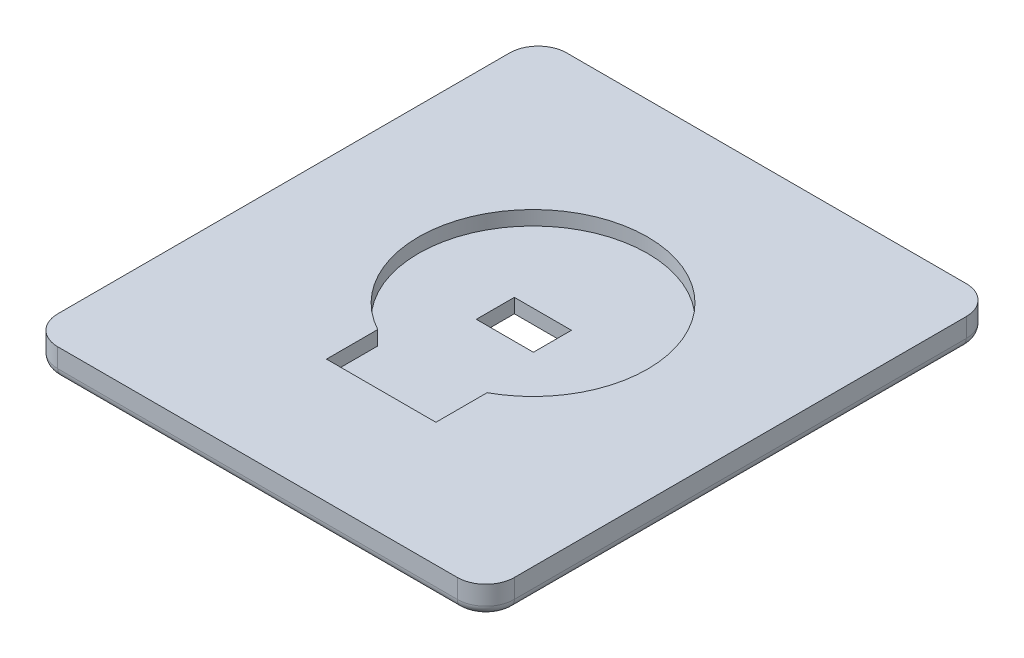
ISO-10303-21;
HEADER;
FILE_DESCRIPTION(('STEP AP214'),'2;1');
FILE_NAME('part.step','',(''),(''),'','','');
FILE_SCHEMA(('AUTOMOTIVE_DESIGN { 1 0 10303 214 1 1 1 1 }'));
ENDSEC;
DATA;
#1=APPLICATION_CONTEXT('core data for automotive mechanical design processes');
#2=APPLICATION_PROTOCOL_DEFINITION('international standard','automotive_design',2000,#1);
#3=PRODUCT_CONTEXT('',#1,'mechanical');
#4=PRODUCT('Part','Part','',(#3));
#5=PRODUCT_RELATED_PRODUCT_CATEGORY('part','',(#4));
#6=PRODUCT_DEFINITION_FORMATION('','',#4);
#7=PRODUCT_DEFINITION_CONTEXT('part definition',#1,'design');
#8=PRODUCT_DEFINITION('design','',#6,#7);
#9=PRODUCT_DEFINITION_SHAPE('','',#8);
#10=(LENGTH_UNIT() NAMED_UNIT(*) SI_UNIT(.MILLI.,.METRE.));
#11=(NAMED_UNIT(*) PLANE_ANGLE_UNIT() SI_UNIT($,.RADIAN.));
#12=(NAMED_UNIT(*) SI_UNIT($,.STERADIAN.) SOLID_ANGLE_UNIT());
#13=UNCERTAINTY_MEASURE_WITH_UNIT(LENGTH_MEASURE(1.E-05),#10,'distance_accuracy_value','');
#14=(GEOMETRIC_REPRESENTATION_CONTEXT(3) GLOBAL_UNCERTAINTY_ASSIGNED_CONTEXT((#13)) GLOBAL_UNIT_ASSIGNED_CONTEXT((#10,
#11,#12)) REPRESENTATION_CONTEXT('',''));
#15=CARTESIAN_POINT('',(0.,0.,0.));
#16=DIRECTION('',(0.,0.,1.));
#17=DIRECTION('',(1.,0.,0.));
#18=AXIS2_PLACEMENT_3D('',#15,#16,#17);
#19=CARTESIAN_POINT('',(0.,3.,0.));
#20=DIRECTION('',(0.,-1.,0.));
#21=DIRECTION('',(0.,0.,-1.));
#22=AXIS2_PLACEMENT_3D('',#19,#20,#21);
#23=PLANE('',#22);
#24=DIRECTION('',(0.,0.,-1.));
#25=VECTOR('',#24,1.);
#26=CARTESIAN_POINT('',(-5.75,3.,0.));
#27=LINE('',#26,#25);
#28=CARTESIAN_POINT('',(-5.75,3.,13.75));
#29=VERTEX_POINT('',#28);
#30=CARTESIAN_POINT('',(-5.75,3.,8.36494754341749));
#31=VERTEX_POINT('',#30);
#32=EDGE_CURVE('E213',#29,#31,#27,.T.);
#33=ORIENTED_EDGE('',*,*,#32,.T.);
#34=CARTESIAN_POINT('',(0.,3.,-2.21153846153821));
#35=DIRECTION('',(0.,1.,0.));
#36=DIRECTION('',(0.,0.,1.));
#37=AXIS2_PLACEMENT_3D('',#34,#35,#36);
#38=CIRCLE('',#37,12.0384615384618);
#39=CARTESIAN_POINT('',(5.75000000000001,3.,8.36494754341749));
#40=VERTEX_POINT('',#39);
#41=EDGE_CURVE('E209',#40,#31,#38,.T.);
#42=ORIENTED_EDGE('',*,*,#41,.F.);
#43=DIRECTION('',(0.,0.,-1.));
#44=VECTOR('',#43,1.);
#45=CARTESIAN_POINT('',(5.75000000000001,3.,0.));
#46=LINE('',#45,#44);
#47=CARTESIAN_POINT('',(5.75000000000001,3.,13.75));
#48=VERTEX_POINT('',#47);
#49=EDGE_CURVE('E223',#48,#40,#46,.T.);
#50=ORIENTED_EDGE('',*,*,#49,.F.);
#51=DIRECTION('',(1.,0.,0.));
#52=VECTOR('',#51,1.);
#53=CARTESIAN_POINT('',(0.,3.,13.75));
#54=LINE('',#53,#52);
#55=EDGE_CURVE('E238',#29,#48,#54,.T.);
#56=ORIENTED_EDGE('',*,*,#55,.F.);
#57=EDGE_LOOP('',(#33,#42,#50,#56));
#58=FACE_BOUND('',#57,.T.);
#59=DIRECTION('',(-1.,0.,0.));
#60=VECTOR('',#59,1.);
#61=CARTESIAN_POINT('',(-24.,3.,-26.75));
#62=LINE('',#61,#60);
#63=CARTESIAN_POINT('',(21.,3.,-26.75));
#64=VERTEX_POINT('',#63);
#65=CARTESIAN_POINT('',(-21.,3.,-26.75));
#66=VERTEX_POINT('',#65);
#67=EDGE_CURVE('E203',#64,#66,#62,.T.);
#68=ORIENTED_EDGE('',*,*,#67,.T.);
#69=CARTESIAN_POINT('',(-21.,3.,-23.75));
#70=DIRECTION('',(0.,-1.,0.));
#71=DIRECTION('',(0.,0.,-1.));
#72=AXIS2_PLACEMENT_3D('',#69,#70,#71);
#73=CIRCLE('',#72,3.);
#74=CARTESIAN_POINT('',(-24.,3.,-23.75));
#75=VERTEX_POINT('',#74);
#76=EDGE_CURVE('E290',#66,#75,#73,.F.);
#77=ORIENTED_EDGE('',*,*,#76,.T.);
#78=DIRECTION('',(0.,0.,1.));
#79=VECTOR('',#78,1.);
#80=CARTESIAN_POINT('',(-24.,3.,26.75));
#81=LINE('',#80,#79);
#82=CARTESIAN_POINT('',(-24.,3.,23.75));
#83=VERTEX_POINT('',#82);
#84=EDGE_CURVE('E382',#75,#83,#81,.T.);
#85=ORIENTED_EDGE('',*,*,#84,.T.);
#86=CARTESIAN_POINT('',(-21.,3.,23.75));
#87=DIRECTION('',(0.,-1.,0.));
#88=DIRECTION('',(0.,0.,-1.));
#89=AXIS2_PLACEMENT_3D('',#86,#87,#88);
#90=CIRCLE('',#89,3.);
#91=CARTESIAN_POINT('',(-21.,3.,26.75));
#92=VERTEX_POINT('',#91);
#93=EDGE_CURVE('E281',#83,#92,#90,.F.);
#94=ORIENTED_EDGE('',*,*,#93,.T.);
#95=DIRECTION('',(1.,0.,0.));
#96=VECTOR('',#95,1.);
#97=CARTESIAN_POINT('',(-24.,3.,26.75));
#98=LINE('',#97,#96);
#99=CARTESIAN_POINT('',(21.,3.,26.75));
#100=VERTEX_POINT('',#99);
#101=EDGE_CURVE('E388',#92,#100,#98,.T.);
#102=ORIENTED_EDGE('',*,*,#101,.T.);
#103=CARTESIAN_POINT('',(21.,3.,23.75));
#104=DIRECTION('',(0.,-1.,0.));
#105=DIRECTION('',(0.,0.,-1.));
#106=AXIS2_PLACEMENT_3D('',#103,#104,#105);
#107=CIRCLE('',#106,3.);
#108=CARTESIAN_POINT('',(24.,3.,23.75));
#109=VERTEX_POINT('',#108);
#110=EDGE_CURVE('E284',#100,#109,#107,.F.);
#111=ORIENTED_EDGE('',*,*,#110,.T.);
#112=DIRECTION('',(0.,0.,-1.));
#113=VECTOR('',#112,1.);
#114=CARTESIAN_POINT('',(24.,3.,26.75));
#115=LINE('',#114,#113);
#116=CARTESIAN_POINT('',(24.,3.,-23.75));
#117=VERTEX_POINT('',#116);
#118=EDGE_CURVE('E395',#109,#117,#115,.T.);
#119=ORIENTED_EDGE('',*,*,#118,.T.);
#120=CARTESIAN_POINT('',(21.,3.,-23.75));
#121=DIRECTION('',(0.,-1.,0.));
#122=DIRECTION('',(0.,0.,-1.));
#123=AXIS2_PLACEMENT_3D('',#120,#121,#122);
#124=CIRCLE('',#123,3.);
#125=EDGE_CURVE('E287',#117,#64,#124,.F.);
#126=ORIENTED_EDGE('',*,*,#125,.T.);
#127=EDGE_LOOP('',(#68,#77,#85,#94,#102,#111,#119,#126));
#128=FACE_BOUND('',#127,.T.);
#129=ADVANCED_FACE('F40',(#58,#128),#23,.F.);
#130=CARTESIAN_POINT('',(0.,0.,0.));
#131=DIRECTION('',(0.,-1.,0.));
#132=DIRECTION('',(0.,0.,-1.));
#133=AXIS2_PLACEMENT_3D('',#130,#131,#132);
#134=PLANE('',#133);
#135=CARTESIAN_POINT('',(21.,0.,23.75));
#136=DIRECTION('',(0.,-1.,0.));
#137=DIRECTION('',(0.,0.,-1.));
#138=AXIS2_PLACEMENT_3D('',#135,#136,#137);
#139=CIRCLE('',#138,2.);
#140=CARTESIAN_POINT('',(23.,0.,23.75));
#141=VERTEX_POINT('',#140);
#142=CARTESIAN_POINT('',(21.,0.,25.75));
#143=VERTEX_POINT('',#142);
#144=EDGE_CURVE('E329',#141,#143,#139,.T.);
#145=ORIENTED_EDGE('',*,*,#144,.T.);
#146=DIRECTION('',(1.,0.,0.));
#147=VECTOR('',#146,1.);
#148=CARTESIAN_POINT('',(-21.,0.,25.75));
#149=LINE('',#148,#147);
#150=CARTESIAN_POINT('',(-21.,0.,25.75));
#151=VERTEX_POINT('',#150);
#152=EDGE_CURVE('E332',#143,#151,#149,.F.);
#153=ORIENTED_EDGE('',*,*,#152,.T.);
#154=CARTESIAN_POINT('',(-21.,0.,23.75));
#155=DIRECTION('',(0.,-1.,0.));
#156=DIRECTION('',(0.,0.,-1.));
#157=AXIS2_PLACEMENT_3D('',#154,#155,#156);
#158=CIRCLE('',#157,2.);
#159=CARTESIAN_POINT('',(-23.,0.,23.75));
#160=VERTEX_POINT('',#159);
#161=EDGE_CURVE('E311',#151,#160,#158,.T.);
#162=ORIENTED_EDGE('',*,*,#161,.T.);
#163=DIRECTION('',(0.,0.,1.));
#164=VECTOR('',#163,1.);
#165=CARTESIAN_POINT('',(-23.,0.,-23.75));
#166=LINE('',#165,#164);
#167=CARTESIAN_POINT('',(-23.,0.,-23.75));
#168=VERTEX_POINT('',#167);
#169=EDGE_CURVE('E314',#160,#168,#166,.F.);
#170=ORIENTED_EDGE('',*,*,#169,.T.);
#171=CARTESIAN_POINT('',(-21.,0.,-23.75));
#172=DIRECTION('',(0.,-1.,0.));
#173=DIRECTION('',(0.,0.,-1.));
#174=AXIS2_PLACEMENT_3D('',#171,#172,#173);
#175=CIRCLE('',#174,2.);
#176=CARTESIAN_POINT('',(-21.,0.,-25.75));
#177=VERTEX_POINT('',#176);
#178=EDGE_CURVE('E317',#168,#177,#175,.T.);
#179=ORIENTED_EDGE('',*,*,#178,.T.);
#180=DIRECTION('',(-1.,0.,0.));
#181=VECTOR('',#180,1.);
#182=CARTESIAN_POINT('',(21.,0.,-25.75));
#183=LINE('',#182,#181);
#184=CARTESIAN_POINT('',(21.,0.,-25.75));
#185=VERTEX_POINT('',#184);
#186=EDGE_CURVE('E320',#177,#185,#183,.F.);
#187=ORIENTED_EDGE('',*,*,#186,.T.);
#188=CARTESIAN_POINT('',(21.,0.,-23.75));
#189=DIRECTION('',(0.,-1.,0.));
#190=DIRECTION('',(0.,0.,-1.));
#191=AXIS2_PLACEMENT_3D('',#188,#189,#190);
#192=CIRCLE('',#191,2.);
#193=CARTESIAN_POINT('',(23.,0.,-23.75));
#194=VERTEX_POINT('',#193);
#195=EDGE_CURVE('E323',#185,#194,#192,.T.);
#196=ORIENTED_EDGE('',*,*,#195,.T.);
#197=DIRECTION('',(0.,0.,-1.));
#198=VECTOR('',#197,1.);
#199=CARTESIAN_POINT('',(23.,0.,23.75));
#200=LINE('',#199,#198);
#201=EDGE_CURVE('E326',#194,#141,#200,.F.);
#202=ORIENTED_EDGE('',*,*,#201,.T.);
#203=EDGE_LOOP('',(#145,#153,#162,#170,#179,#187,#196,#202));
#204=FACE_BOUND('',#203,.T.);
#205=DIRECTION('',(0.,0.,-1.));
#206=VECTOR('',#205,1.);
#207=CARTESIAN_POINT('',(-3.,0.,0.));
#208=LINE('',#207,#206);
#209=CARTESIAN_POINT('',(-3.,0.,0.750000000000002));
#210=VERTEX_POINT('',#209);
#211=CARTESIAN_POINT('',(-3.,0.,-3.25));
#212=VERTEX_POINT('',#211);
#213=EDGE_CURVE('E197',#210,#212,#208,.T.);
#214=ORIENTED_EDGE('',*,*,#213,.F.);
#215=DIRECTION('',(-1.,0.,0.));
#216=VECTOR('',#215,1.);
#217=CARTESIAN_POINT('',(0.,0.,0.750000000000002));
#218=LINE('',#217,#216);
#219=CARTESIAN_POINT('',(3.00000000000001,0.,0.750000000000002));
#220=VERTEX_POINT('',#219);
#221=EDGE_CURVE('E179',#220,#210,#218,.T.);
#222=ORIENTED_EDGE('',*,*,#221,.F.);
#223=DIRECTION('',(0.,0.,1.));
#224=VECTOR('',#223,1.);
#225=CARTESIAN_POINT('',(3.00000000000001,0.,0.));
#226=LINE('',#225,#224);
#227=CARTESIAN_POINT('',(3.00000000000001,0.,-3.25));
#228=VERTEX_POINT('',#227);
#229=EDGE_CURVE('E191',#228,#220,#226,.T.);
#230=ORIENTED_EDGE('',*,*,#229,.F.);
#231=DIRECTION('',(1.,0.,0.));
#232=VECTOR('',#231,1.);
#233=CARTESIAN_POINT('',(0.,0.,-3.25));
#234=LINE('',#233,#232);
#235=EDGE_CURVE('E207',#212,#228,#234,.T.);
#236=ORIENTED_EDGE('',*,*,#235,.F.);
#237=EDGE_LOOP('',(#214,#222,#230,#236));
#238=FACE_BOUND('',#237,.T.);
#239=ADVANCED_FACE('F206',(#204,#238),#134,.T.);
#240=CARTESIAN_POINT('',(0.,1.5,-2.21153846153821));
#241=DIRECTION('',(0.,1.,0.));
#242=DIRECTION('',(0.,0.,1.));
#243=AXIS2_PLACEMENT_3D('',#240,#241,#242);
#244=CYLINDRICAL_SURFACE('',#243,12.0384615384618);
#245=ORIENTED_EDGE('',*,*,#41,.T.);
#246=DIRECTION('',(0.,1.,0.));
#247=VECTOR('',#246,1.);
#248=CARTESIAN_POINT('',(-5.75,1.5,8.36494754341749));
#249=LINE('',#248,#247);
#250=CARTESIAN_POINT('',(-5.75,1.5,8.36494754341749));
#251=VERTEX_POINT('',#250);
#252=EDGE_CURVE('E233',#251,#31,#249,.T.);
#253=ORIENTED_EDGE('',*,*,#252,.F.);
#254=CARTESIAN_POINT('',(0.,1.5,-2.21153846153821));
#255=DIRECTION('',(0.,1.,0.));
#256=DIRECTION('',(0.,0.,1.));
#257=AXIS2_PLACEMENT_3D('',#254,#255,#256);
#258=CIRCLE('',#257,12.0384615384618);
#259=CARTESIAN_POINT('',(5.75000000000001,1.5,8.36494754341749));
#260=VERTEX_POINT('',#259);
#261=EDGE_CURVE('E218',#260,#251,#258,.T.);
#262=ORIENTED_EDGE('',*,*,#261,.F.);
#263=DIRECTION('',(0.,1.,0.));
#264=VECTOR('',#263,1.);
#265=CARTESIAN_POINT('',(5.75000000000001,1.5,8.36494754341749));
#266=LINE('',#265,#264);
#267=EDGE_CURVE('E245',#260,#40,#266,.T.);
#268=ORIENTED_EDGE('',*,*,#267,.T.);
#269=EDGE_LOOP('',(#245,#253,#262,#268));
#270=FACE_BOUND('',#269,.T.);
#271=ADVANCED_FACE('F431',(#270),#244,.F.);
#272=CARTESIAN_POINT('',(5.75000000000001,1.5,0.));
#273=DIRECTION('',(1.,0.,0.));
#274=DIRECTION('',(0.,0.,-1.));
#275=AXIS2_PLACEMENT_3D('',#272,#273,#274);
#276=PLANE('',#275);
#277=ORIENTED_EDGE('',*,*,#49,.T.);
#278=ORIENTED_EDGE('',*,*,#267,.F.);
#279=DIRECTION('',(0.,0.,-1.));
#280=VECTOR('',#279,1.);
#281=CARTESIAN_POINT('',(5.75000000000001,1.5,0.));
#282=LINE('',#281,#280);
#283=CARTESIAN_POINT('',(5.75000000000001,1.5,13.75));
#284=VERTEX_POINT('',#283);
#285=EDGE_CURVE('E230',#284,#260,#282,.T.);
#286=ORIENTED_EDGE('',*,*,#285,.F.);
#287=DIRECTION('',(0.,1.,0.));
#288=VECTOR('',#287,1.);
#289=CARTESIAN_POINT('',(5.75000000000001,1.5,13.75));
#290=LINE('',#289,#288);
#291=EDGE_CURVE('E249',#284,#48,#290,.T.);
#292=ORIENTED_EDGE('',*,*,#291,.T.);
#293=EDGE_LOOP('',(#277,#278,#286,#292));
#294=FACE_BOUND('',#293,.T.);
#295=ADVANCED_FACE('F441',(#294),#276,.F.);
#296=CARTESIAN_POINT('',(0.,1.5,13.75));
#297=DIRECTION('',(0.,0.,1.));
#298=DIRECTION('',(1.,0.,0.));
#299=AXIS2_PLACEMENT_3D('',#296,#297,#298);
#300=PLANE('',#299);
#301=ORIENTED_EDGE('',*,*,#55,.T.);
#302=ORIENTED_EDGE('',*,*,#291,.F.);
#303=DIRECTION('',(1.,0.,0.));
#304=VECTOR('',#303,1.);
#305=CARTESIAN_POINT('',(0.,1.5,13.75));
#306=LINE('',#305,#304);
#307=CARTESIAN_POINT('',(-5.75,1.5,13.75));
#308=VERTEX_POINT('',#307);
#309=EDGE_CURVE('E226',#308,#284,#306,.T.);
#310=ORIENTED_EDGE('',*,*,#309,.F.);
#311=DIRECTION('',(0.,1.,0.));
#312=VECTOR('',#311,1.);
#313=CARTESIAN_POINT('',(-5.75,1.5,13.75));
#314=LINE('',#313,#312);
#315=EDGE_CURVE('E252',#308,#29,#314,.T.);
#316=ORIENTED_EDGE('',*,*,#315,.T.);
#317=EDGE_LOOP('',(#301,#302,#310,#316));
#318=FACE_BOUND('',#317,.T.);
#319=ADVANCED_FACE('F439',(#318),#300,.F.);
#320=CARTESIAN_POINT('',(-5.75,1.5,0.));
#321=DIRECTION('',(1.,0.,0.));
#322=DIRECTION('',(0.,0.,-1.));
#323=AXIS2_PLACEMENT_3D('',#320,#321,#322);
#324=PLANE('',#323);
#325=ORIENTED_EDGE('',*,*,#32,.F.);
#326=ORIENTED_EDGE('',*,*,#315,.F.);
#327=DIRECTION('',(0.,0.,-1.));
#328=VECTOR('',#327,1.);
#329=CARTESIAN_POINT('',(-5.75,1.5,0.));
#330=LINE('',#329,#328);
#331=EDGE_CURVE('E222',#308,#251,#330,.T.);
#332=ORIENTED_EDGE('',*,*,#331,.T.);
#333=ORIENTED_EDGE('',*,*,#252,.T.);
#334=EDGE_LOOP('',(#325,#326,#332,#333));
#335=FACE_BOUND('',#334,.T.);
#336=ADVANCED_FACE('F423',(#335),#324,.T.);
#337=CARTESIAN_POINT('',(0.,1.5,0.));
#338=DIRECTION('',(0.,1.,0.));
#339=DIRECTION('',(0.,0.,1.));
#340=AXIS2_PLACEMENT_3D('',#337,#338,#339);
#341=PLANE('',#340);
#342=DIRECTION('',(0.,0.,1.));
#343=VECTOR('',#342,1.);
#344=CARTESIAN_POINT('',(-3.,1.5,0.));
#345=LINE('',#344,#343);
#346=CARTESIAN_POINT('',(-3.,1.5,-3.25));
#347=VERTEX_POINT('',#346);
#348=CARTESIAN_POINT('',(-3.,1.5,0.750000000000002));
#349=VERTEX_POINT('',#348);
#350=EDGE_CURVE('E200',#347,#349,#345,.T.);
#351=ORIENTED_EDGE('',*,*,#350,.F.);
#352=DIRECTION('',(-1.,0.,0.));
#353=VECTOR('',#352,1.);
#354=CARTESIAN_POINT('',(0.,1.5,-3.25));
#355=LINE('',#354,#353);
#356=CARTESIAN_POINT('',(3.00000000000001,1.5,-3.25));
#357=VERTEX_POINT('',#356);
#358=EDGE_CURVE('E263',#357,#347,#355,.T.);
#359=ORIENTED_EDGE('',*,*,#358,.F.);
#360=DIRECTION('',(0.,0.,-1.));
#361=VECTOR('',#360,1.);
#362=CARTESIAN_POINT('',(3.00000000000001,1.5,0.));
#363=LINE('',#362,#361);
#364=CARTESIAN_POINT('',(3.00000000000001,1.5,0.750000000000002));
#365=VERTEX_POINT('',#364);
#366=EDGE_CURVE('E260',#365,#357,#363,.T.);
#367=ORIENTED_EDGE('',*,*,#366,.F.);
#368=DIRECTION('',(1.,0.,0.));
#369=VECTOR('',#368,1.);
#370=CARTESIAN_POINT('',(0.,1.5,0.750000000000002));
#371=LINE('',#370,#369);
#372=EDGE_CURVE('E248',#349,#365,#371,.T.);
#373=ORIENTED_EDGE('',*,*,#372,.F.);
#374=EDGE_LOOP('',(#351,#359,#367,#373));
#375=FACE_BOUND('',#374,.T.);
#376=ORIENTED_EDGE('',*,*,#261,.T.);
#377=ORIENTED_EDGE('',*,*,#331,.F.);
#378=ORIENTED_EDGE('',*,*,#309,.T.);
#379=ORIENTED_EDGE('',*,*,#285,.T.);
#380=EDGE_LOOP('',(#376,#377,#378,#379));
#381=FACE_BOUND('',#380,.T.);
#382=ADVANCED_FACE('F420',(#375,#381),#341,.T.);
#383=CARTESIAN_POINT('',(-3.,-2.,0.750000000000002));
#384=DIRECTION('',(-1.,0.,0.));
#385=DIRECTION('',(0.,0.,1.));
#386=AXIS2_PLACEMENT_3D('',#383,#384,#385);
#387=PLANE('',#386);
#388=ORIENTED_EDGE('',*,*,#213,.T.);
#389=DIRECTION('',(0.,1.,0.));
#390=VECTOR('',#389,1.);
#391=CARTESIAN_POINT('',(-3.,-2.,-3.25));
#392=LINE('',#391,#390);
#393=EDGE_CURVE('E192',#212,#347,#392,.T.);
#394=ORIENTED_EDGE('',*,*,#393,.T.);
#395=ORIENTED_EDGE('',*,*,#350,.T.);
#396=DIRECTION('',(0.,1.,0.));
#397=VECTOR('',#396,1.);
#398=CARTESIAN_POINT('',(-3.,-2.,0.750000000000002));
#399=LINE('',#398,#397);
#400=EDGE_CURVE('E182',#210,#349,#399,.T.);
#401=ORIENTED_EDGE('',*,*,#400,.F.);
#402=EDGE_LOOP('',(#388,#394,#395,#401));
#403=FACE_BOUND('',#402,.T.);
#404=ADVANCED_FACE('F195',(#403),#387,.F.);
#405=CARTESIAN_POINT('',(-3.,-2.,-3.25));
#406=DIRECTION('',(0.,0.,-1.));
#407=DIRECTION('',(-1.,0.,0.));
#408=AXIS2_PLACEMENT_3D('',#405,#406,#407);
#409=PLANE('',#408);
#410=ORIENTED_EDGE('',*,*,#235,.T.);
#411=DIRECTION('',(0.,1.,0.));
#412=VECTOR('',#411,1.);
#413=CARTESIAN_POINT('',(3.00000000000001,-2.,-3.25));
#414=LINE('',#413,#412);
#415=EDGE_CURVE('E406',#228,#357,#414,.T.);
#416=ORIENTED_EDGE('',*,*,#415,.T.);
#417=ORIENTED_EDGE('',*,*,#358,.T.);
#418=ORIENTED_EDGE('',*,*,#393,.F.);
#419=EDGE_LOOP('',(#410,#416,#417,#418));
#420=FACE_BOUND('',#419,.T.);
#421=ADVANCED_FACE('F418',(#420),#409,.F.);
#422=CARTESIAN_POINT('',(3.00000000000001,-2.,0.750000000000002));
#423=DIRECTION('',(1.,0.,0.));
#424=DIRECTION('',(0.,0.,-1.));
#425=AXIS2_PLACEMENT_3D('',#422,#423,#424);
#426=PLANE('',#425);
#427=ORIENTED_EDGE('',*,*,#229,.T.);
#428=DIRECTION('',(0.,1.,0.));
#429=VECTOR('',#428,1.);
#430=CARTESIAN_POINT('',(3.00000000000001,-2.,0.750000000000002));
#431=LINE('',#430,#429);
#432=EDGE_CURVE('E185',#220,#365,#431,.T.);
#433=ORIENTED_EDGE('',*,*,#432,.T.);
#434=ORIENTED_EDGE('',*,*,#366,.T.);
#435=ORIENTED_EDGE('',*,*,#415,.F.);
#436=EDGE_LOOP('',(#427,#433,#434,#435));
#437=FACE_BOUND('',#436,.T.);
#438=ADVANCED_FACE('F414',(#437),#426,.F.);
#439=CARTESIAN_POINT('',(-3.,-2.,0.750000000000002));
#440=DIRECTION('',(0.,0.,1.));
#441=DIRECTION('',(1.,0.,0.));
#442=AXIS2_PLACEMENT_3D('',#439,#440,#441);
#443=PLANE('',#442);
#444=ORIENTED_EDGE('',*,*,#221,.T.);
#445=ORIENTED_EDGE('',*,*,#400,.T.);
#446=ORIENTED_EDGE('',*,*,#372,.T.);
#447=ORIENTED_EDGE('',*,*,#432,.F.);
#448=EDGE_LOOP('',(#444,#445,#446,#447));
#449=FACE_BOUND('',#448,.T.);
#450=ADVANCED_FACE('F181',(#449),#443,.F.);
#451=CARTESIAN_POINT('',(-24.,3.,26.75));
#452=DIRECTION('',(1.,0.,0.));
#453=DIRECTION('',(0.,0.,-1.));
#454=AXIS2_PLACEMENT_3D('',#451,#452,#453);
#455=PLANE('',#454);
#456=DIRECTION('',(0.,-1.,0.));
#457=VECTOR('',#456,1.);
#458=CARTESIAN_POINT('',(-24.,3.,-23.75));
#459=LINE('',#458,#457);
#460=CARTESIAN_POINT('',(-24.,1.,-23.75));
#461=VERTEX_POINT('',#460);
#462=EDGE_CURVE('E271',#75,#461,#459,.T.);
#463=ORIENTED_EDGE('',*,*,#462,.T.);
#464=DIRECTION('',(0.,0.,1.));
#465=VECTOR('',#464,1.);
#466=CARTESIAN_POINT('',(-24.,1.,23.75));
#467=LINE('',#466,#465);
#468=CARTESIAN_POINT('',(-24.,1.,23.75));
#469=VERTEX_POINT('',#468);
#470=EDGE_CURVE('E50',#461,#469,#467,.T.);
#471=ORIENTED_EDGE('',*,*,#470,.T.);
#472=DIRECTION('',(0.,-1.,0.));
#473=VECTOR('',#472,1.);
#474=CARTESIAN_POINT('',(-24.,3.,23.75));
#475=LINE('',#474,#473);
#476=EDGE_CURVE('E268',#469,#83,#475,.F.);
#477=ORIENTED_EDGE('',*,*,#476,.T.);
#478=ORIENTED_EDGE('',*,*,#84,.F.);
#479=EDGE_LOOP('',(#463,#471,#477,#478));
#480=FACE_BOUND('',#479,.T.);
#481=ADVANCED_FACE('F538',(#480),#455,.F.);
#482=CARTESIAN_POINT('',(-24.,3.,26.75));
#483=DIRECTION('',(0.,0.,-1.));
#484=DIRECTION('',(-1.,0.,0.));
#485=AXIS2_PLACEMENT_3D('',#482,#483,#484);
#486=PLANE('',#485);
#487=DIRECTION('',(0.,-1.,0.));
#488=VECTOR('',#487,1.);
#489=CARTESIAN_POINT('',(-21.,3.,26.75));
#490=LINE('',#489,#488);
#491=CARTESIAN_POINT('',(-21.,1.,26.75));
#492=VERTEX_POINT('',#491);
#493=EDGE_CURVE('E300',#92,#492,#490,.T.);
#494=ORIENTED_EDGE('',*,*,#493,.T.);
#495=DIRECTION('',(1.,0.,0.));
#496=VECTOR('',#495,1.);
#497=CARTESIAN_POINT('',(21.,1.,26.75));
#498=LINE('',#497,#496);
#499=CARTESIAN_POINT('',(21.,1.,26.75));
#500=VERTEX_POINT('',#499);
#501=EDGE_CURVE('E307',#492,#500,#498,.T.);
#502=ORIENTED_EDGE('',*,*,#501,.T.);
#503=DIRECTION('',(0.,-1.,0.));
#504=VECTOR('',#503,1.);
#505=CARTESIAN_POINT('',(21.,3.,26.75));
#506=LINE('',#505,#504);
#507=EDGE_CURVE('E304',#500,#100,#506,.F.);
#508=ORIENTED_EDGE('',*,*,#507,.T.);
#509=ORIENTED_EDGE('',*,*,#101,.F.);
#510=EDGE_LOOP('',(#494,#502,#508,#509));
#511=FACE_BOUND('',#510,.T.);
#512=ADVANCED_FACE('F520',(#511),#486,.F.);
#513=CARTESIAN_POINT('',(24.,3.,26.75));
#514=DIRECTION('',(-1.,0.,0.));
#515=DIRECTION('',(0.,0.,1.));
#516=AXIS2_PLACEMENT_3D('',#513,#514,#515);
#517=PLANE('',#516);
#518=DIRECTION('',(0.,-1.,0.));
#519=VECTOR('',#518,1.);
#520=CARTESIAN_POINT('',(24.,3.,23.75));
#521=LINE('',#520,#519);
#522=CARTESIAN_POINT('',(24.,1.,23.75));
#523=VERTEX_POINT('',#522);
#524=EDGE_CURVE('E293',#109,#523,#521,.T.);
#525=ORIENTED_EDGE('',*,*,#524,.T.);
#526=DIRECTION('',(0.,0.,-1.));
#527=VECTOR('',#526,1.);
#528=CARTESIAN_POINT('',(24.,1.,-23.75));
#529=LINE('',#528,#527);
#530=CARTESIAN_POINT('',(24.,1.,-23.75));
#531=VERTEX_POINT('',#530);
#532=EDGE_CURVE('E339',#523,#531,#529,.T.);
#533=ORIENTED_EDGE('',*,*,#532,.T.);
#534=DIRECTION('',(0.,-1.,0.));
#535=VECTOR('',#534,1.);
#536=CARTESIAN_POINT('',(24.,3.,-23.75));
#537=LINE('',#536,#535);
#538=EDGE_CURVE('E297',#531,#117,#537,.F.);
#539=ORIENTED_EDGE('',*,*,#538,.T.);
#540=ORIENTED_EDGE('',*,*,#118,.F.);
#541=EDGE_LOOP('',(#525,#533,#539,#540));
#542=FACE_BOUND('',#541,.T.);
#543=ADVANCED_FACE('F528',(#542),#517,.F.);
#544=CARTESIAN_POINT('',(-24.,3.,-26.75));
#545=DIRECTION('',(0.,0.,1.));
#546=DIRECTION('',(1.,0.,0.));
#547=AXIS2_PLACEMENT_3D('',#544,#545,#546);
#548=PLANE('',#547);
#549=DIRECTION('',(0.,-1.,0.));
#550=VECTOR('',#549,1.);
#551=CARTESIAN_POINT('',(21.,3.,-26.75));
#552=LINE('',#551,#550);
#553=CARTESIAN_POINT('',(21.,1.,-26.75));
#554=VERTEX_POINT('',#553);
#555=EDGE_CURVE('E274',#64,#554,#552,.T.);
#556=ORIENTED_EDGE('',*,*,#555,.T.);
#557=DIRECTION('',(-1.,0.,0.));
#558=VECTOR('',#557,1.);
#559=CARTESIAN_POINT('',(-21.,1.,-26.75));
#560=LINE('',#559,#558);
#561=CARTESIAN_POINT('',(-21.,1.,-26.75));
#562=VERTEX_POINT('',#561);
#563=EDGE_CURVE('E345',#554,#562,#560,.T.);
#564=ORIENTED_EDGE('',*,*,#563,.T.);
#565=DIRECTION('',(0.,-1.,0.));
#566=VECTOR('',#565,1.);
#567=CARTESIAN_POINT('',(-21.,3.,-26.75));
#568=LINE('',#567,#566);
#569=EDGE_CURVE('E278',#562,#66,#568,.F.);
#570=ORIENTED_EDGE('',*,*,#569,.T.);
#571=ORIENTED_EDGE('',*,*,#67,.F.);
#572=EDGE_LOOP('',(#556,#564,#570,#571));
#573=FACE_BOUND('',#572,.T.);
#574=ADVANCED_FACE('F463',(#573),#548,.F.);
#575=CARTESIAN_POINT('',(-21.,3.,-23.75));
#576=DIRECTION('',(0.,-1.,0.));
#577=DIRECTION('',(0.,0.,-1.));
#578=AXIS2_PLACEMENT_3D('',#575,#576,#577);
#579=CYLINDRICAL_SURFACE('',#578,3.);
#580=ORIENTED_EDGE('',*,*,#569,.F.);
#581=CARTESIAN_POINT('',(-21.,1.,-23.75));
#582=DIRECTION('',(0.,-1.,0.));
#583=DIRECTION('',(0.,0.,-1.));
#584=AXIS2_PLACEMENT_3D('',#581,#582,#583);
#585=CIRCLE('',#584,3.);
#586=EDGE_CURVE('E65',#562,#461,#585,.F.);
#587=ORIENTED_EDGE('',*,*,#586,.T.);
#588=ORIENTED_EDGE('',*,*,#462,.F.);
#589=ORIENTED_EDGE('',*,*,#76,.F.);
#590=EDGE_LOOP('',(#580,#587,#588,#589));
#591=FACE_BOUND('',#590,.T.);
#592=ADVANCED_FACE('F459',(#591),#579,.T.);
#593=CARTESIAN_POINT('',(21.,3.,-23.75));
#594=DIRECTION('',(0.,-1.,0.));
#595=DIRECTION('',(0.,0.,-1.));
#596=AXIS2_PLACEMENT_3D('',#593,#594,#595);
#597=CYLINDRICAL_SURFACE('',#596,3.);
#598=ORIENTED_EDGE('',*,*,#538,.F.);
#599=CARTESIAN_POINT('',(21.,1.,-23.75));
#600=DIRECTION('',(0.,-1.,0.));
#601=DIRECTION('',(0.,0.,-1.));
#602=AXIS2_PLACEMENT_3D('',#599,#600,#601);
#603=CIRCLE('',#602,3.);
#604=EDGE_CURVE('E342',#531,#554,#603,.F.);
#605=ORIENTED_EDGE('',*,*,#604,.T.);
#606=ORIENTED_EDGE('',*,*,#555,.F.);
#607=ORIENTED_EDGE('',*,*,#125,.F.);
#608=EDGE_LOOP('',(#598,#605,#606,#607));
#609=FACE_BOUND('',#608,.T.);
#610=ADVANCED_FACE('F462',(#609),#597,.T.);
#611=CARTESIAN_POINT('',(21.,3.,23.75));
#612=DIRECTION('',(0.,-1.,0.));
#613=DIRECTION('',(0.,0.,-1.));
#614=AXIS2_PLACEMENT_3D('',#611,#612,#613);
#615=CYLINDRICAL_SURFACE('',#614,3.);
#616=ORIENTED_EDGE('',*,*,#507,.F.);
#617=CARTESIAN_POINT('',(21.,1.,23.75));
#618=DIRECTION('',(0.,-1.,0.));
#619=DIRECTION('',(0.,0.,-1.));
#620=AXIS2_PLACEMENT_3D('',#617,#618,#619);
#621=CIRCLE('',#620,3.);
#622=EDGE_CURVE('E336',#500,#523,#621,.F.);
#623=ORIENTED_EDGE('',*,*,#622,.T.);
#624=ORIENTED_EDGE('',*,*,#524,.F.);
#625=ORIENTED_EDGE('',*,*,#110,.F.);
#626=EDGE_LOOP('',(#616,#623,#624,#625));
#627=FACE_BOUND('',#626,.T.);
#628=ADVANCED_FACE('F466',(#627),#615,.T.);
#629=CARTESIAN_POINT('',(-21.,3.,23.75));
#630=DIRECTION('',(0.,-1.,0.));
#631=DIRECTION('',(0.,0.,-1.));
#632=AXIS2_PLACEMENT_3D('',#629,#630,#631);
#633=CYLINDRICAL_SURFACE('',#632,3.);
#634=ORIENTED_EDGE('',*,*,#476,.F.);
#635=CARTESIAN_POINT('',(-21.,1.,23.75));
#636=DIRECTION('',(0.,-1.,0.));
#637=DIRECTION('',(0.,0.,-1.));
#638=AXIS2_PLACEMENT_3D('',#635,#636,#637);
#639=CIRCLE('',#638,3.);
#640=EDGE_CURVE('E11',#469,#492,#639,.F.);
#641=ORIENTED_EDGE('',*,*,#640,.T.);
#642=ORIENTED_EDGE('',*,*,#493,.F.);
#643=ORIENTED_EDGE('',*,*,#93,.F.);
#644=EDGE_LOOP('',(#634,#641,#642,#643));
#645=FACE_BOUND('',#644,.T.);
#646=ADVANCED_FACE('F470',(#645),#633,.T.);
#647=CARTESIAN_POINT('',(-24.,1.,-25.75));
#648=DIRECTION('',(1.,0.,0.));
#649=DIRECTION('',(0.,0.,-1.));
#650=AXIS2_PLACEMENT_3D('',#647,#648,#649);
#651=CYLINDRICAL_SURFACE('',#650,1.);
#652=CARTESIAN_POINT('',(21.,1.,-25.75));
#653=DIRECTION('',(1.,0.,0.));
#654=DIRECTION('',(0.,0.,-1.));
#655=AXIS2_PLACEMENT_3D('',#652,#653,#654);
#656=CIRCLE('',#655,1.);
#657=EDGE_CURVE('E373',#185,#554,#656,.T.);
#658=ORIENTED_EDGE('',*,*,#657,.F.);
#659=ORIENTED_EDGE('',*,*,#186,.F.);
#660=CARTESIAN_POINT('',(-21.,1.,-25.75));
#661=DIRECTION('',(-1.,0.,0.));
#662=DIRECTION('',(0.,0.,1.));
#663=AXIS2_PLACEMENT_3D('',#660,#661,#662);
#664=CIRCLE('',#663,1.);
#665=EDGE_CURVE('E44',#562,#177,#664,.T.);
#666=ORIENTED_EDGE('',*,*,#665,.F.);
#667=ORIENTED_EDGE('',*,*,#563,.F.);
#668=EDGE_LOOP('',(#658,#659,#666,#667));
#669=FACE_BOUND('',#668,.T.);
#670=ADVANCED_FACE('F42',(#669),#651,.T.);
#671=CARTESIAN_POINT('',(-21.,1.,-23.75));
#672=DIRECTION('',(0.,-1.,0.));
#673=DIRECTION('',(0.,0.,-1.));
#674=AXIS2_PLACEMENT_3D('',#671,#672,#673);
#675=TOROIDAL_SURFACE('',#674,2.,1.);
#676=ORIENTED_EDGE('',*,*,#665,.T.);
#677=ORIENTED_EDGE('',*,*,#178,.F.);
#678=CARTESIAN_POINT('',(-23.,1.,-23.75));
#679=DIRECTION('',(0.,0.,1.));
#680=DIRECTION('',(1.,0.,0.));
#681=AXIS2_PLACEMENT_3D('',#678,#679,#680);
#682=CIRCLE('',#681,1.);
#683=EDGE_CURVE('E370',#461,#168,#682,.T.);
#684=ORIENTED_EDGE('',*,*,#683,.F.);
#685=ORIENTED_EDGE('',*,*,#586,.F.);
#686=EDGE_LOOP('',(#676,#677,#684,#685));
#687=FACE_BOUND('',#686,.T.);
#688=ADVANCED_FACE('F497',(#687),#675,.T.);
#689=CARTESIAN_POINT('',(21.,1.,-23.75));
#690=DIRECTION('',(0.,-1.,0.));
#691=DIRECTION('',(0.,0.,-1.));
#692=AXIS2_PLACEMENT_3D('',#689,#690,#691);
#693=TOROIDAL_SURFACE('',#692,2.,1.);
#694=ORIENTED_EDGE('',*,*,#657,.T.);
#695=ORIENTED_EDGE('',*,*,#604,.F.);
#696=CARTESIAN_POINT('',(23.,1.,-23.75));
#697=DIRECTION('',(0.,0.,1.));
#698=DIRECTION('',(1.,0.,0.));
#699=AXIS2_PLACEMENT_3D('',#696,#697,#698);
#700=CIRCLE('',#699,1.);
#701=EDGE_CURVE('E366',#194,#531,#700,.T.);
#702=ORIENTED_EDGE('',*,*,#701,.F.);
#703=ORIENTED_EDGE('',*,*,#195,.F.);
#704=EDGE_LOOP('',(#694,#695,#702,#703));
#705=FACE_BOUND('',#704,.T.);
#706=ADVANCED_FACE('F494',(#705),#693,.T.);
#707=CARTESIAN_POINT('',(-23.,1.,26.75));
#708=DIRECTION('',(0.,0.,-1.));
#709=DIRECTION('',(-1.,0.,0.));
#710=AXIS2_PLACEMENT_3D('',#707,#708,#709);
#711=CYLINDRICAL_SURFACE('',#710,1.);
#712=ORIENTED_EDGE('',*,*,#683,.T.);
#713=ORIENTED_EDGE('',*,*,#169,.F.);
#714=CARTESIAN_POINT('',(-23.,1.,23.75));
#715=DIRECTION('',(0.,0.,1.));
#716=DIRECTION('',(1.,0.,0.));
#717=AXIS2_PLACEMENT_3D('',#714,#715,#716);
#718=CIRCLE('',#717,1.);
#719=EDGE_CURVE('E362',#469,#160,#718,.T.);
#720=ORIENTED_EDGE('',*,*,#719,.F.);
#721=ORIENTED_EDGE('',*,*,#470,.F.);
#722=EDGE_LOOP('',(#712,#713,#720,#721));
#723=FACE_BOUND('',#722,.T.);
#724=ADVANCED_FACE('F490',(#723),#711,.T.);
#725=CARTESIAN_POINT('',(23.,1.,26.75));
#726=DIRECTION('',(0.,0.,1.));
#727=DIRECTION('',(1.,0.,0.));
#728=AXIS2_PLACEMENT_3D('',#725,#726,#727);
#729=CYLINDRICAL_SURFACE('',#728,1.);
#730=ORIENTED_EDGE('',*,*,#701,.T.);
#731=ORIENTED_EDGE('',*,*,#532,.F.);
#732=CARTESIAN_POINT('',(23.,1.,23.75));
#733=DIRECTION('',(0.,0.,1.));
#734=DIRECTION('',(1.,0.,0.));
#735=AXIS2_PLACEMENT_3D('',#732,#733,#734);
#736=CIRCLE('',#735,1.);
#737=EDGE_CURVE('E358',#141,#523,#736,.T.);
#738=ORIENTED_EDGE('',*,*,#737,.F.);
#739=ORIENTED_EDGE('',*,*,#201,.F.);
#740=EDGE_LOOP('',(#730,#731,#738,#739));
#741=FACE_BOUND('',#740,.T.);
#742=ADVANCED_FACE('F486',(#741),#729,.T.);
#743=CARTESIAN_POINT('',(-21.,1.,23.75));
#744=DIRECTION('',(0.,-1.,0.));
#745=DIRECTION('',(0.,0.,-1.));
#746=AXIS2_PLACEMENT_3D('',#743,#744,#745);
#747=TOROIDAL_SURFACE('',#746,2.,1.);
#748=ORIENTED_EDGE('',*,*,#719,.T.);
#749=ORIENTED_EDGE('',*,*,#161,.F.);
#750=CARTESIAN_POINT('',(-21.,1.,25.75));
#751=DIRECTION('',(1.,0.,0.));
#752=DIRECTION('',(0.,0.,-1.));
#753=AXIS2_PLACEMENT_3D('',#750,#751,#752);
#754=CIRCLE('',#753,1.);
#755=EDGE_CURVE('E355',#492,#151,#754,.T.);
#756=ORIENTED_EDGE('',*,*,#755,.F.);
#757=ORIENTED_EDGE('',*,*,#640,.F.);
#758=EDGE_LOOP('',(#748,#749,#756,#757));
#759=FACE_BOUND('',#758,.T.);
#760=ADVANCED_FACE('F482',(#759),#747,.T.);
#761=CARTESIAN_POINT('',(21.,1.,23.75));
#762=DIRECTION('',(0.,-1.,0.));
#763=DIRECTION('',(0.,0.,-1.));
#764=AXIS2_PLACEMENT_3D('',#761,#762,#763);
#765=TOROIDAL_SURFACE('',#764,2.,1.);
#766=ORIENTED_EDGE('',*,*,#737,.T.);
#767=ORIENTED_EDGE('',*,*,#622,.F.);
#768=CARTESIAN_POINT('',(21.,1.,25.75));
#769=DIRECTION('',(-1.,0.,0.));
#770=DIRECTION('',(0.,0.,1.));
#771=AXIS2_PLACEMENT_3D('',#768,#769,#770);
#772=CIRCLE('',#771,1.);
#773=EDGE_CURVE('E352',#143,#500,#772,.T.);
#774=ORIENTED_EDGE('',*,*,#773,.F.);
#775=ORIENTED_EDGE('',*,*,#144,.F.);
#776=EDGE_LOOP('',(#766,#767,#774,#775));
#777=FACE_BOUND('',#776,.T.);
#778=ADVANCED_FACE('F478',(#777),#765,.T.);
#779=CARTESIAN_POINT('',(-24.,1.,25.75));
#780=DIRECTION('',(-1.,0.,0.));
#781=DIRECTION('',(0.,0.,1.));
#782=AXIS2_PLACEMENT_3D('',#779,#780,#781);
#783=CYLINDRICAL_SURFACE('',#782,1.);
#784=ORIENTED_EDGE('',*,*,#755,.T.);
#785=ORIENTED_EDGE('',*,*,#152,.F.);
#786=ORIENTED_EDGE('',*,*,#773,.T.);
#787=ORIENTED_EDGE('',*,*,#501,.F.);
#788=EDGE_LOOP('',(#784,#785,#786,#787));
#789=FACE_BOUND('',#788,.T.);
#790=ADVANCED_FACE('F475',(#789),#783,.T.);
#791=CLOSED_SHELL('',(#129,#239,#271,#295,#319,#336,#382,#404,#421,#438,#450,#481,#512,#543,
#574,#592,#610,#628,#646,#670,#688,#706,#724,#742,#760,#778,#790));
#792=MANIFOLD_SOLID_BREP('B2',#791);
#793=ADVANCED_BREP_SHAPE_REPRESENTATION('',(#18,#792),#14);
#794=SHAPE_DEFINITION_REPRESENTATION(#9,#793);
ENDSEC;
END-ISO-10303-21;
